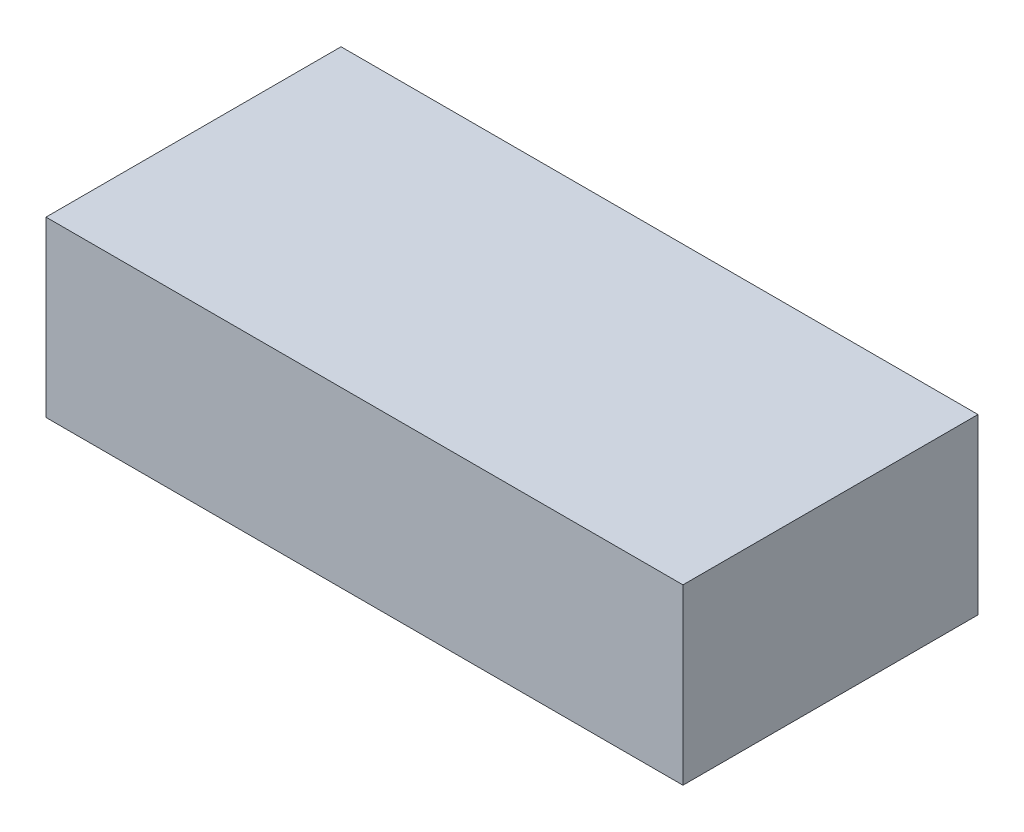
ISO-10303-21;
HEADER;
FILE_DESCRIPTION(('STEP AP214'),'2;1');
FILE_NAME('part.step','',(''),(''),'','','');
FILE_SCHEMA(('AUTOMOTIVE_DESIGN { 1 0 10303 214 1 1 1 1 }'));
ENDSEC;
DATA;
#1=APPLICATION_CONTEXT('core data for automotive mechanical design processes');
#2=APPLICATION_PROTOCOL_DEFINITION('international standard','automotive_design',2000,#1);
#3=PRODUCT_CONTEXT('',#1,'mechanical');
#4=PRODUCT('Part','Part','',(#3));
#5=PRODUCT_RELATED_PRODUCT_CATEGORY('part','',(#4));
#6=PRODUCT_DEFINITION_FORMATION('','',#4);
#7=PRODUCT_DEFINITION_CONTEXT('part definition',#1,'design');
#8=PRODUCT_DEFINITION('design','',#6,#7);
#9=PRODUCT_DEFINITION_SHAPE('','',#8);
#10=(LENGTH_UNIT() NAMED_UNIT(*) SI_UNIT(.MILLI.,.METRE.));
#11=(NAMED_UNIT(*) PLANE_ANGLE_UNIT() SI_UNIT($,.RADIAN.));
#12=(NAMED_UNIT(*) SI_UNIT($,.STERADIAN.) SOLID_ANGLE_UNIT());
#13=UNCERTAINTY_MEASURE_WITH_UNIT(LENGTH_MEASURE(1.E-05),#10,'distance_accuracy_value','');
#14=(GEOMETRIC_REPRESENTATION_CONTEXT(3) GLOBAL_UNCERTAINTY_ASSIGNED_CONTEXT((#13)) GLOBAL_UNIT_ASSIGNED_CONTEXT((#10,
#11,#12)) REPRESENTATION_CONTEXT('',''));
#15=CARTESIAN_POINT('',(0.,0.,0.));
#16=DIRECTION('',(0.,0.,1.));
#17=DIRECTION('',(1.,0.,0.));
#18=AXIS2_PLACEMENT_3D('',#15,#16,#17);
#19=CARTESIAN_POINT('',(44.3935729668058,10.,-27.5306434105217));
#20=DIRECTION('',(-1.,0.,0.));
#21=DIRECTION('',(0.,0.,1.));
#22=AXIS2_PLACEMENT_3D('',#19,#20,#21);
#23=PLANE('',#22);
#24=DIRECTION('',(0.,0.,-1.));
#25=VECTOR('',#24,1.);
#26=CARTESIAN_POINT('',(44.3935729668058,0.,-27.5306434105217));
#27=LINE('',#26,#25);
#28=CARTESIAN_POINT('',(44.3935729668058,0.,-10.5306434105217));
#29=VERTEX_POINT('',#28);
#30=CARTESIAN_POINT('',(44.3935729668058,0.,-27.5306434105217));
#31=VERTEX_POINT('',#30);
#32=EDGE_CURVE('E115',#29,#31,#27,.T.);
#33=ORIENTED_EDGE('',*,*,#32,.T.);
#34=DIRECTION('',(0.,-1.,0.));
#35=VECTOR('',#34,1.);
#36=CARTESIAN_POINT('',(44.3935729668058,10.,-27.5306434105217));
#37=LINE('',#36,#35);
#38=CARTESIAN_POINT('',(44.3935729668058,10.,-27.5306434105217));
#39=VERTEX_POINT('',#38);
#40=EDGE_CURVE('E11',#39,#31,#37,.T.);
#41=ORIENTED_EDGE('',*,*,#40,.F.);
#42=DIRECTION('',(0.,0.,-1.));
#43=VECTOR('',#42,1.);
#44=CARTESIAN_POINT('',(44.3935729668058,10.,-27.5306434105217));
#45=LINE('',#44,#43);
#46=CARTESIAN_POINT('',(44.3935729668058,10.,-10.5306434105217));
#47=VERTEX_POINT('',#46);
#48=EDGE_CURVE('E99',#47,#39,#45,.T.);
#49=ORIENTED_EDGE('',*,*,#48,.F.);
#50=DIRECTION('',(0.,-1.,0.));
#51=VECTOR('',#50,1.);
#52=CARTESIAN_POINT('',(44.3935729668058,10.,-10.5306434105217));
#53=LINE('',#52,#51);
#54=EDGE_CURVE('E111',#47,#29,#53,.T.);
#55=ORIENTED_EDGE('',*,*,#54,.T.);
#56=EDGE_LOOP('',(#33,#41,#49,#55));
#57=FACE_BOUND('',#56,.T.);
#58=ADVANCED_FACE('F47',(#57),#23,.F.);
#59=CARTESIAN_POINT('',(7.69357296680575,10.,-27.5306434105217));
#60=DIRECTION('',(0.,0.,1.));
#61=DIRECTION('',(1.,0.,0.));
#62=AXIS2_PLACEMENT_3D('',#59,#60,#61);
#63=PLANE('',#62);
#64=DIRECTION('',(-1.,0.,0.));
#65=VECTOR('',#64,1.);
#66=CARTESIAN_POINT('',(7.69357296680575,0.,-27.5306434105217));
#67=LINE('',#66,#65);
#68=CARTESIAN_POINT('',(7.69357296680575,0.,-27.5306434105217));
#69=VERTEX_POINT('',#68);
#70=EDGE_CURVE('E104',#31,#69,#67,.T.);
#71=ORIENTED_EDGE('',*,*,#70,.T.);
#72=DIRECTION('',(0.,-1.,0.));
#73=VECTOR('',#72,1.);
#74=CARTESIAN_POINT('',(7.69357296680575,10.,-27.5306434105217));
#75=LINE('',#74,#73);
#76=CARTESIAN_POINT('',(7.69357296680575,10.,-27.5306434105217));
#77=VERTEX_POINT('',#76);
#78=EDGE_CURVE('E56',#77,#69,#75,.T.);
#79=ORIENTED_EDGE('',*,*,#78,.F.);
#80=DIRECTION('',(-1.,0.,0.));
#81=VECTOR('',#80,1.);
#82=CARTESIAN_POINT('',(7.69357296680575,10.,-27.5306434105217));
#83=LINE('',#82,#81);
#84=EDGE_CURVE('E94',#39,#77,#83,.T.);
#85=ORIENTED_EDGE('',*,*,#84,.F.);
#86=ORIENTED_EDGE('',*,*,#40,.T.);
#87=EDGE_LOOP('',(#71,#79,#85,#86));
#88=FACE_BOUND('',#87,.T.);
#89=ADVANCED_FACE('F103',(#88),#63,.F.);
#90=CARTESIAN_POINT('',(7.69357296680575,10.,-27.5306434105217));
#91=DIRECTION('',(1.,0.,0.));
#92=DIRECTION('',(0.,0.,-1.));
#93=AXIS2_PLACEMENT_3D('',#90,#91,#92);
#94=PLANE('',#93);
#95=DIRECTION('',(0.,0.,1.));
#96=VECTOR('',#95,1.);
#97=CARTESIAN_POINT('',(7.69357296680575,0.,-27.5306434105217));
#98=LINE('',#97,#96);
#99=CARTESIAN_POINT('',(7.69357296680575,0.,-10.5306434105217));
#100=VERTEX_POINT('',#99);
#101=EDGE_CURVE('E81',#69,#100,#98,.T.);
#102=ORIENTED_EDGE('',*,*,#101,.T.);
#103=DIRECTION('',(0.,-1.,0.));
#104=VECTOR('',#103,1.);
#105=CARTESIAN_POINT('',(7.69357296680575,10.,-10.5306434105217));
#106=LINE('',#105,#104);
#107=CARTESIAN_POINT('',(7.69357296680575,10.,-10.5306434105217));
#108=VERTEX_POINT('',#107);
#109=EDGE_CURVE('E106',#108,#100,#106,.T.);
#110=ORIENTED_EDGE('',*,*,#109,.F.);
#111=DIRECTION('',(0.,0.,1.));
#112=VECTOR('',#111,1.);
#113=CARTESIAN_POINT('',(7.69357296680575,10.,-27.5306434105217));
#114=LINE('',#113,#112);
#115=EDGE_CURVE('E97',#77,#108,#114,.T.);
#116=ORIENTED_EDGE('',*,*,#115,.F.);
#117=ORIENTED_EDGE('',*,*,#78,.T.);
#118=EDGE_LOOP('',(#102,#110,#116,#117));
#119=FACE_BOUND('',#118,.T.);
#120=ADVANCED_FACE('F107',(#119),#94,.F.);
#121=CARTESIAN_POINT('',(7.69357296680575,10.,-10.5306434105217));
#122=DIRECTION('',(0.,0.,-1.));
#123=DIRECTION('',(-1.,0.,0.));
#124=AXIS2_PLACEMENT_3D('',#121,#122,#123);
#125=PLANE('',#124);
#126=DIRECTION('',(1.,0.,0.));
#127=VECTOR('',#126,1.);
#128=CARTESIAN_POINT('',(7.69357296680575,0.,-10.5306434105217));
#129=LINE('',#128,#127);
#130=EDGE_CURVE('E87',#100,#29,#129,.T.);
#131=ORIENTED_EDGE('',*,*,#130,.T.);
#132=ORIENTED_EDGE('',*,*,#54,.F.);
#133=DIRECTION('',(1.,0.,0.));
#134=VECTOR('',#133,1.);
#135=CARTESIAN_POINT('',(7.69357296680575,10.,-10.5306434105217));
#136=LINE('',#135,#134);
#137=EDGE_CURVE('E64',#108,#47,#136,.T.);
#138=ORIENTED_EDGE('',*,*,#137,.F.);
#139=ORIENTED_EDGE('',*,*,#109,.T.);
#140=EDGE_LOOP('',(#131,#132,#138,#139));
#141=FACE_BOUND('',#140,.T.);
#142=ADVANCED_FACE('F128',(#141),#125,.F.);
#143=CARTESIAN_POINT('',(0.,10.,0.));
#144=DIRECTION('',(0.,1.,0.));
#145=DIRECTION('',(0.,0.,1.));
#146=AXIS2_PLACEMENT_3D('',#143,#144,#145);
#147=PLANE('',#146);
#148=ORIENTED_EDGE('',*,*,#48,.T.);
#149=ORIENTED_EDGE('',*,*,#84,.T.);
#150=ORIENTED_EDGE('',*,*,#115,.T.);
#151=ORIENTED_EDGE('',*,*,#137,.T.);
#152=EDGE_LOOP('',(#148,#149,#150,#151));
#153=FACE_BOUND('',#152,.T.);
#154=ADVANCED_FACE('F95',(#153),#147,.T.);
#155=CARTESIAN_POINT('',(0.,0.,0.));
#156=DIRECTION('',(0.,1.,0.));
#157=DIRECTION('',(0.,0.,1.));
#158=AXIS2_PLACEMENT_3D('',#155,#156,#157);
#159=PLANE('',#158);
#160=ORIENTED_EDGE('',*,*,#32,.F.);
#161=ORIENTED_EDGE('',*,*,#130,.F.);
#162=ORIENTED_EDGE('',*,*,#101,.F.);
#163=ORIENTED_EDGE('',*,*,#70,.F.);
#164=EDGE_LOOP('',(#160,#161,#162,#163));
#165=FACE_BOUND('',#164,.T.);
#166=ADVANCED_FACE('F131',(#165),#159,.F.);
#167=CLOSED_SHELL('',(#58,#89,#120,#142,#154,#166));
#168=MANIFOLD_SOLID_BREP('B2',#167);
#169=ADVANCED_BREP_SHAPE_REPRESENTATION('',(#18,#168),#14);
#170=SHAPE_DEFINITION_REPRESENTATION(#9,#169);
ENDSEC;
END-ISO-10303-21;
